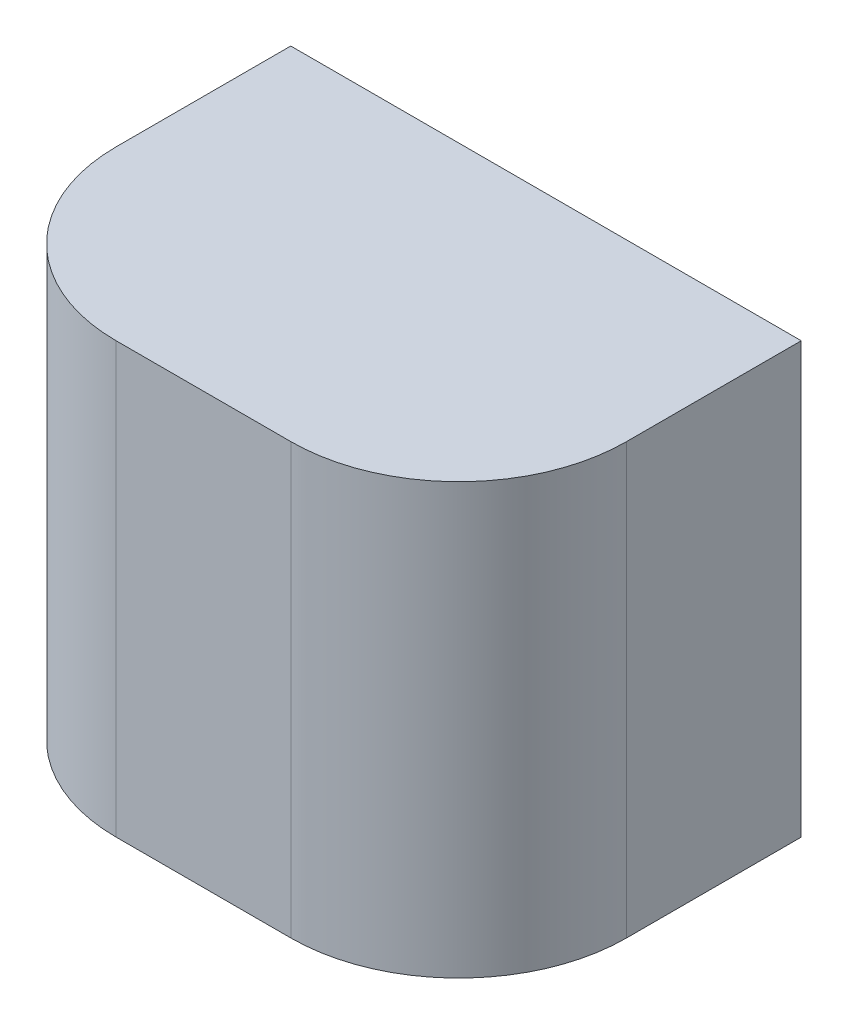
ISO-10303-21;
HEADER;
FILE_DESCRIPTION(('STEP AP214'),'2;1');
FILE_NAME('part.step','',(''),(''),'','','');
FILE_SCHEMA(('AUTOMOTIVE_DESIGN { 1 0 10303 214 1 1 1 1 }'));
ENDSEC;
DATA;
#1=APPLICATION_CONTEXT('core data for automotive mechanical design processes');
#2=APPLICATION_PROTOCOL_DEFINITION('international standard','automotive_design',2000,#1);
#3=PRODUCT_CONTEXT('',#1,'mechanical');
#4=PRODUCT('Part','Part','',(#3));
#5=PRODUCT_RELATED_PRODUCT_CATEGORY('part','',(#4));
#6=PRODUCT_DEFINITION_FORMATION('','',#4);
#7=PRODUCT_DEFINITION_CONTEXT('part definition',#1,'design');
#8=PRODUCT_DEFINITION('design','',#6,#7);
#9=PRODUCT_DEFINITION_SHAPE('','',#8);
#10=(LENGTH_UNIT() NAMED_UNIT(*) SI_UNIT(.MILLI.,.METRE.));
#11=(NAMED_UNIT(*) PLANE_ANGLE_UNIT() SI_UNIT($,.RADIAN.));
#12=(NAMED_UNIT(*) SI_UNIT($,.STERADIAN.) SOLID_ANGLE_UNIT());
#13=UNCERTAINTY_MEASURE_WITH_UNIT(LENGTH_MEASURE(1.E-05),#10,'distance_accuracy_value','');
#14=(GEOMETRIC_REPRESENTATION_CONTEXT(3) GLOBAL_UNCERTAINTY_ASSIGNED_CONTEXT((#13)) GLOBAL_UNIT_ASSIGNED_CONTEXT((#10,
#11,#12)) REPRESENTATION_CONTEXT('',''));
#15=CARTESIAN_POINT('',(0.,0.,0.));
#16=DIRECTION('',(0.,0.,1.));
#17=DIRECTION('',(1.,0.,0.));
#18=AXIS2_PLACEMENT_3D('',#15,#16,#17);
#19=CARTESIAN_POINT('',(-1.65,0.,1.395));
#20=DIRECTION('',(-1.,0.,0.));
#21=DIRECTION('',(0.,0.,1.));
#22=AXIS2_PLACEMENT_3D('',#19,#20,#21);
#23=PLANE('',#22);
#24=DIRECTION('',(0.,0.,-1.));
#25=VECTOR('',#24,1.);
#26=CARTESIAN_POINT('',(-1.65,-0.64,1.395));
#27=LINE('',#26,#25);
#28=CARTESIAN_POINT('',(-1.65,-0.64,1.655));
#29=VERTEX_POINT('',#28);
#30=CARTESIAN_POINT('',(-1.65,-0.64,1.395));
#31=VERTEX_POINT('',#30);
#32=EDGE_CURVE('E11',#29,#31,#27,.T.);
#33=ORIENTED_EDGE('',*,*,#32,.F.);
#34=DIRECTION('',(0.,-1.,0.));
#35=VECTOR('',#34,1.);
#36=CARTESIAN_POINT('',(-1.65,0.,1.655));
#37=LINE('',#36,#35);
#38=CARTESIAN_POINT('',(-1.65,0.,1.655));
#39=VERTEX_POINT('',#38);
#40=EDGE_CURVE('E24',#39,#29,#37,.T.);
#41=ORIENTED_EDGE('',*,*,#40,.F.);
#42=DIRECTION('',(0.,0.,-1.));
#43=VECTOR('',#42,1.);
#44=CARTESIAN_POINT('',(-1.65,0.,1.395));
#45=LINE('',#44,#43);
#46=CARTESIAN_POINT('',(-1.65,0.,1.395));
#47=VERTEX_POINT('',#46);
#48=EDGE_CURVE('E119',#39,#47,#45,.T.);
#49=ORIENTED_EDGE('',*,*,#48,.T.);
#50=DIRECTION('',(0.,-1.,0.));
#51=VECTOR('',#50,1.);
#52=CARTESIAN_POINT('',(-1.65,0.,1.395));
#53=LINE('',#52,#51);
#54=EDGE_CURVE('E90',#47,#31,#53,.T.);
#55=ORIENTED_EDGE('',*,*,#54,.T.);
#56=EDGE_LOOP('',(#33,#41,#49,#55));
#57=FACE_BOUND('',#56,.T.);
#58=ADVANCED_FACE('F17',(#57),#23,.T.);
#59=CARTESIAN_POINT('',(-1.4,0.,1.655));
#60=DIRECTION('',(0.,-1.,0.));
#61=DIRECTION('',(0.,0.,-1.));
#62=AXIS2_PLACEMENT_3D('',#59,#60,#61);
#63=CYLINDRICAL_SURFACE('',#62,0.25);
#64=CARTESIAN_POINT('',(-1.4,-0.64,1.655));
#65=DIRECTION('',(0.,-1.,0.));
#66=DIRECTION('',(0.,0.,1.));
#67=AXIS2_PLACEMENT_3D('',#64,#65,#66);
#68=CIRCLE('',#67,0.25);
#69=CARTESIAN_POINT('',(-1.4,-0.64,1.905));
#70=VERTEX_POINT('',#69);
#71=EDGE_CURVE('E116',#70,#29,#68,.T.);
#72=ORIENTED_EDGE('',*,*,#71,.F.);
#73=DIRECTION('',(0.,-1.,0.));
#74=VECTOR('',#73,1.);
#75=CARTESIAN_POINT('',(-1.4,0.,1.905));
#76=LINE('',#75,#74);
#77=CARTESIAN_POINT('',(-1.4,0.,1.905));
#78=VERTEX_POINT('',#77);
#79=EDGE_CURVE('E113',#78,#70,#76,.T.);
#80=ORIENTED_EDGE('',*,*,#79,.F.);
#81=CARTESIAN_POINT('',(-1.4,0.,1.655));
#82=DIRECTION('',(0.,-1.,0.));
#83=DIRECTION('',(0.,0.,1.));
#84=AXIS2_PLACEMENT_3D('',#81,#82,#83);
#85=CIRCLE('',#84,0.25);
#86=EDGE_CURVE('E110',#78,#39,#85,.T.);
#87=ORIENTED_EDGE('',*,*,#86,.T.);
#88=ORIENTED_EDGE('',*,*,#40,.T.);
#89=EDGE_LOOP('',(#72,#80,#87,#88));
#90=FACE_BOUND('',#89,.T.);
#91=ADVANCED_FACE('F121',(#90),#63,.T.);
#92=CARTESIAN_POINT('',(-1.4,0.,1.905));
#93=DIRECTION('',(0.,0.,1.));
#94=DIRECTION('',(1.,0.,0.));
#95=AXIS2_PLACEMENT_3D('',#92,#93,#94);
#96=PLANE('',#95);
#97=DIRECTION('',(-1.,0.,0.));
#98=VECTOR('',#97,1.);
#99=CARTESIAN_POINT('',(-1.4,-0.64,1.905));
#100=LINE('',#99,#98);
#101=CARTESIAN_POINT('',(-1.14,-0.64,1.905));
#102=VERTEX_POINT('',#101);
#103=EDGE_CURVE('E107',#102,#70,#100,.T.);
#104=ORIENTED_EDGE('',*,*,#103,.F.);
#105=DIRECTION('',(0.,-1.,0.));
#106=VECTOR('',#105,1.);
#107=CARTESIAN_POINT('',(-1.14,0.,1.905));
#108=LINE('',#107,#106);
#109=CARTESIAN_POINT('',(-1.14,0.,1.905));
#110=VERTEX_POINT('',#109);
#111=EDGE_CURVE('E104',#110,#102,#108,.T.);
#112=ORIENTED_EDGE('',*,*,#111,.F.);
#113=DIRECTION('',(-1.,0.,0.));
#114=VECTOR('',#113,1.);
#115=CARTESIAN_POINT('',(-1.4,0.,1.905));
#116=LINE('',#115,#114);
#117=EDGE_CURVE('E101',#110,#78,#116,.T.);
#118=ORIENTED_EDGE('',*,*,#117,.T.);
#119=ORIENTED_EDGE('',*,*,#79,.T.);
#120=EDGE_LOOP('',(#104,#112,#118,#119));
#121=FACE_BOUND('',#120,.T.);
#122=ADVANCED_FACE('F125',(#121),#96,.T.);
#123=CARTESIAN_POINT('',(-1.14,0.,1.655));
#124=DIRECTION('',(0.,-1.,0.));
#125=DIRECTION('',(0.,0.,-1.));
#126=AXIS2_PLACEMENT_3D('',#123,#124,#125);
#127=CYLINDRICAL_SURFACE('',#126,0.25);
#128=CARTESIAN_POINT('',(-1.14,-0.64,1.655));
#129=DIRECTION('',(0.,-1.,0.));
#130=DIRECTION('',(0.,0.,1.));
#131=AXIS2_PLACEMENT_3D('',#128,#129,#130);
#132=CIRCLE('',#131,0.25);
#133=CARTESIAN_POINT('',(-0.89,-0.64,1.655));
#134=VERTEX_POINT('',#133);
#135=EDGE_CURVE('E98',#134,#102,#132,.T.);
#136=ORIENTED_EDGE('',*,*,#135,.F.);
#137=DIRECTION('',(0.,-1.,0.));
#138=VECTOR('',#137,1.);
#139=CARTESIAN_POINT('',(-0.89,0.,1.655));
#140=LINE('',#139,#138);
#141=CARTESIAN_POINT('',(-0.89,0.,1.655));
#142=VERTEX_POINT('',#141);
#143=EDGE_CURVE('E96',#142,#134,#140,.T.);
#144=ORIENTED_EDGE('',*,*,#143,.F.);
#145=CARTESIAN_POINT('',(-1.14,0.,1.655));
#146=DIRECTION('',(0.,-1.,0.));
#147=DIRECTION('',(0.,0.,1.));
#148=AXIS2_PLACEMENT_3D('',#145,#146,#147);
#149=CIRCLE('',#148,0.25);
#150=EDGE_CURVE('E85',#142,#110,#149,.T.);
#151=ORIENTED_EDGE('',*,*,#150,.T.);
#152=ORIENTED_EDGE('',*,*,#111,.T.);
#153=EDGE_LOOP('',(#136,#144,#151,#152));
#154=FACE_BOUND('',#153,.T.);
#155=ADVANCED_FACE('F127',(#154),#127,.T.);
#156=CARTESIAN_POINT('',(-0.89,0.,1.395));
#157=DIRECTION('',(1.,0.,0.));
#158=DIRECTION('',(0.,0.,-1.));
#159=AXIS2_PLACEMENT_3D('',#156,#157,#158);
#160=PLANE('',#159);
#161=DIRECTION('',(0.,0.,1.));
#162=VECTOR('',#161,1.);
#163=CARTESIAN_POINT('',(-0.89,-0.64,1.395));
#164=LINE('',#163,#162);
#165=CARTESIAN_POINT('',(-0.89,-0.64,1.395));
#166=VERTEX_POINT('',#165);
#167=EDGE_CURVE('E72',#166,#134,#164,.T.);
#168=ORIENTED_EDGE('',*,*,#167,.F.);
#169=DIRECTION('',(0.,-1.,0.));
#170=VECTOR('',#169,1.);
#171=CARTESIAN_POINT('',(-0.89,0.,1.395));
#172=LINE('',#171,#170);
#173=CARTESIAN_POINT('',(-0.89,0.,1.395));
#174=VERTEX_POINT('',#173);
#175=EDGE_CURVE('E66',#174,#166,#172,.T.);
#176=ORIENTED_EDGE('',*,*,#175,.F.);
#177=DIRECTION('',(0.,0.,1.));
#178=VECTOR('',#177,1.);
#179=CARTESIAN_POINT('',(-0.89,0.,1.395));
#180=LINE('',#179,#178);
#181=EDGE_CURVE('E70',#174,#142,#180,.T.);
#182=ORIENTED_EDGE('',*,*,#181,.T.);
#183=ORIENTED_EDGE('',*,*,#143,.T.);
#184=EDGE_LOOP('',(#168,#176,#182,#183));
#185=FACE_BOUND('',#184,.T.);
#186=ADVANCED_FACE('F68',(#185),#160,.T.);
#187=CARTESIAN_POINT('',(-1.65,0.,1.395));
#188=DIRECTION('',(0.,0.,-1.));
#189=DIRECTION('',(-1.,0.,0.));
#190=AXIS2_PLACEMENT_3D('',#187,#188,#189);
#191=PLANE('',#190);
#192=DIRECTION('',(1.,0.,0.));
#193=VECTOR('',#192,1.);
#194=CARTESIAN_POINT('',(-1.65,-0.64,1.395));
#195=LINE('',#194,#193);
#196=EDGE_CURVE('E86',#31,#166,#195,.T.);
#197=ORIENTED_EDGE('',*,*,#196,.F.);
#198=ORIENTED_EDGE('',*,*,#54,.F.);
#199=DIRECTION('',(1.,0.,0.));
#200=VECTOR('',#199,1.);
#201=CARTESIAN_POINT('',(-1.65,0.,1.395));
#202=LINE('',#201,#200);
#203=EDGE_CURVE('E82',#47,#174,#202,.T.);
#204=ORIENTED_EDGE('',*,*,#203,.T.);
#205=ORIENTED_EDGE('',*,*,#175,.T.);
#206=EDGE_LOOP('',(#197,#198,#204,#205));
#207=FACE_BOUND('',#206,.T.);
#208=ADVANCED_FACE('F89',(#207),#191,.T.);
#209=CARTESIAN_POINT('',(-1.4,0.,1.655));
#210=DIRECTION('',(0.,1.,0.));
#211=DIRECTION('',(0.,0.,1.));
#212=AXIS2_PLACEMENT_3D('',#209,#210,#211);
#213=PLANE('',#212);
#214=ORIENTED_EDGE('',*,*,#48,.F.);
#215=ORIENTED_EDGE('',*,*,#86,.F.);
#216=ORIENTED_EDGE('',*,*,#117,.F.);
#217=ORIENTED_EDGE('',*,*,#150,.F.);
#218=ORIENTED_EDGE('',*,*,#181,.F.);
#219=ORIENTED_EDGE('',*,*,#203,.F.);
#220=EDGE_LOOP('',(#214,#215,#216,#217,#218,#219));
#221=FACE_BOUND('',#220,.T.);
#222=ADVANCED_FACE('F81',(#221),#213,.T.);
#223=CARTESIAN_POINT('',(-1.4,-0.64,1.655));
#224=DIRECTION('',(0.,1.,0.));
#225=DIRECTION('',(0.,0.,1.));
#226=AXIS2_PLACEMENT_3D('',#223,#224,#225);
#227=PLANE('',#226);
#228=ORIENTED_EDGE('',*,*,#32,.T.);
#229=ORIENTED_EDGE('',*,*,#196,.T.);
#230=ORIENTED_EDGE('',*,*,#167,.T.);
#231=ORIENTED_EDGE('',*,*,#135,.T.);
#232=ORIENTED_EDGE('',*,*,#103,.T.);
#233=ORIENTED_EDGE('',*,*,#71,.T.);
#234=EDGE_LOOP('',(#228,#229,#230,#231,#232,#233));
#235=FACE_BOUND('',#234,.T.);
#236=ADVANCED_FACE('F123',(#235),#227,.F.);
#237=CLOSED_SHELL('',(#58,#91,#122,#155,#186,#208,#222,#236));
#238=MANIFOLD_SOLID_BREP('B1',#237);
#239=ADVANCED_BREP_SHAPE_REPRESENTATION('',(#18,#238),#14);
#240=SHAPE_DEFINITION_REPRESENTATION(#9,#239);
ENDSEC;
END-ISO-10303-21;
